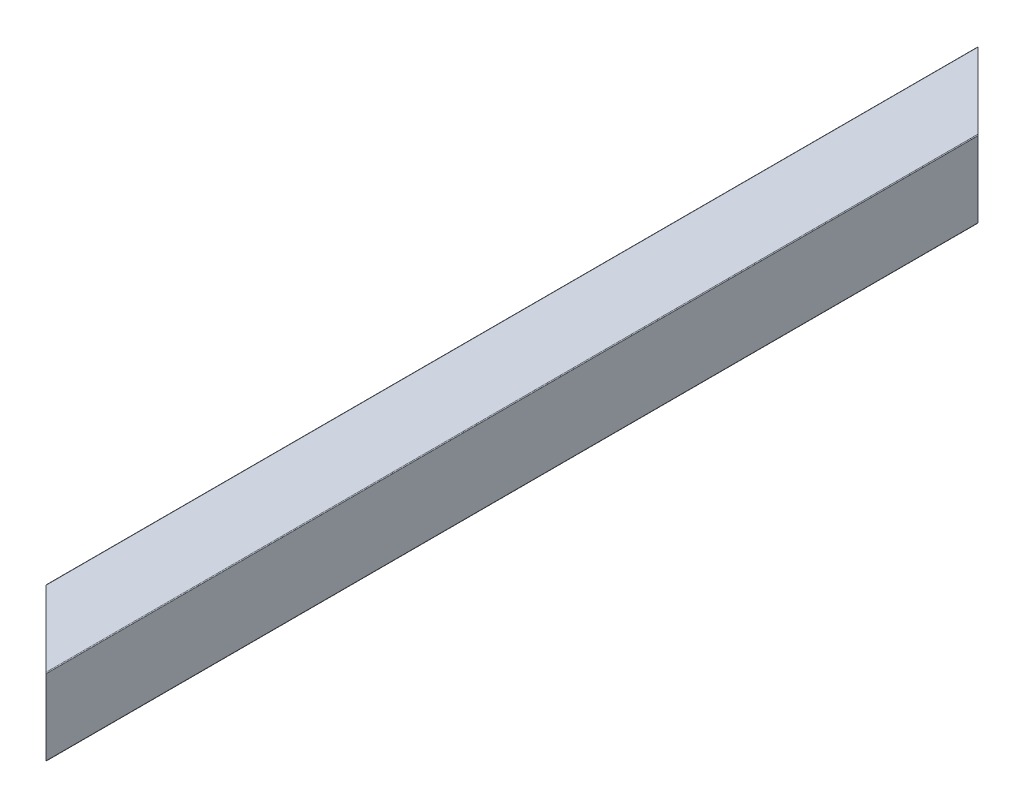
ISO-10303-21;
HEADER;
FILE_DESCRIPTION(('STEP AP214'),'2;1');
FILE_NAME('part.step','',(''),(''),'','','');
FILE_SCHEMA(('AUTOMOTIVE_DESIGN { 1 0 10303 214 1 1 1 1 }'));
ENDSEC;
DATA;
#1=APPLICATION_CONTEXT('core data for automotive mechanical design processes');
#2=APPLICATION_PROTOCOL_DEFINITION('international standard','automotive_design',2000,#1);
#3=PRODUCT_CONTEXT('',#1,'mechanical');
#4=PRODUCT('Part','Part','',(#3));
#5=PRODUCT_RELATED_PRODUCT_CATEGORY('part','',(#4));
#6=PRODUCT_DEFINITION_FORMATION('','',#4);
#7=PRODUCT_DEFINITION_CONTEXT('part definition',#1,'design');
#8=PRODUCT_DEFINITION('design','',#6,#7);
#9=PRODUCT_DEFINITION_SHAPE('','',#8);
#10=(LENGTH_UNIT() NAMED_UNIT(*) SI_UNIT(.MILLI.,.METRE.));
#11=(NAMED_UNIT(*) PLANE_ANGLE_UNIT() SI_UNIT($,.RADIAN.));
#12=(NAMED_UNIT(*) SI_UNIT($,.STERADIAN.) SOLID_ANGLE_UNIT());
#13=UNCERTAINTY_MEASURE_WITH_UNIT(LENGTH_MEASURE(1.E-05),#10,'distance_accuracy_value','');
#14=(GEOMETRIC_REPRESENTATION_CONTEXT(3) GLOBAL_UNCERTAINTY_ASSIGNED_CONTEXT((#13)) GLOBAL_UNIT_ASSIGNED_CONTEXT((#10,
#11,#12)) REPRESENTATION_CONTEXT('',''));
#15=CARTESIAN_POINT('',(0.,0.,0.));
#16=DIRECTION('',(0.,0.,1.));
#17=DIRECTION('',(1.,0.,0.));
#18=AXIS2_PLACEMENT_3D('',#15,#16,#17);
#19=CARTESIAN_POINT('',(3.175,4.7625,1828.8));
#20=DIRECTION('',(1.,0.,0.));
#21=DIRECTION('',(0.,1.,0.));
#22=AXIS2_PLACEMENT_3D('',#19,#20,#21);
#23=PLANE('',#22);
#24=DIRECTION('',(0.,1.,0.));
#25=VECTOR('',#24,1.);
#26=CARTESIAN_POINT('',(3.175,4.7625,1806.575));
#27=LINE('',#26,#25);
#28=CARTESIAN_POINT('',(3.175,4.7625,1806.575));
#29=VERTEX_POINT('',#28);
#30=CARTESIAN_POINT('',(3.175,20.6375,1806.575));
#31=VERTEX_POINT('',#30);
#32=EDGE_CURVE('E334',#29,#31,#27,.T.);
#33=ORIENTED_EDGE('',*,*,#32,.F.);
#34=DIRECTION('',(0.,0.,-1.));
#35=VECTOR('',#34,1.);
#36=CARTESIAN_POINT('',(3.175,4.7625,1828.8));
#37=LINE('',#36,#35);
#38=CARTESIAN_POINT('',(3.175,4.7625,1498.219));
#39=VERTEX_POINT('',#38);
#40=EDGE_CURVE('E69',#29,#39,#37,.T.);
#41=ORIENTED_EDGE('',*,*,#40,.T.);
#42=DIRECTION('',(0.,-1.,0.));
#43=VECTOR('',#42,1.);
#44=CARTESIAN_POINT('',(3.175,4.7625,1498.219));
#45=LINE('',#44,#43);
#46=CARTESIAN_POINT('',(3.175,20.6375,1498.219));
#47=VERTEX_POINT('',#46);
#48=EDGE_CURVE('E282',#47,#39,#45,.T.);
#49=ORIENTED_EDGE('',*,*,#48,.F.);
#50=DIRECTION('',(0.,0.,-1.));
#51=VECTOR('',#50,1.);
#52=CARTESIAN_POINT('',(3.175,20.6375,1828.8));
#53=LINE('',#52,#51);
#54=EDGE_CURVE('E11',#31,#47,#53,.T.);
#55=ORIENTED_EDGE('',*,*,#54,.F.);
#56=EDGE_LOOP('',(#33,#41,#49,#55));
#57=FACE_BOUND('',#56,.T.);
#58=ADVANCED_FACE('F43',(#57),#23,.T.);
#59=CARTESIAN_POINT('',(4.7625,20.6375,1828.8));
#60=DIRECTION('',(0.,0.,-1.));
#61=DIRECTION('',(-1.,0.,0.));
#62=AXIS2_PLACEMENT_3D('',#59,#60,#61);
#63=CYLINDRICAL_SURFACE('',#62,1.5875);
#64=DIRECTION('',(0.,0.,-1.));
#65=VECTOR('',#64,1.);
#66=CARTESIAN_POINT('',(4.7625,22.225,1828.8));
#67=LINE('',#66,#65);
#68=CARTESIAN_POINT('',(4.7625,22.225,1808.1625));
#69=VERTEX_POINT('',#68);
#70=CARTESIAN_POINT('',(4.7625,22.225,1499.8065));
#71=VERTEX_POINT('',#70);
#72=EDGE_CURVE('E53',#69,#71,#67,.T.);
#73=ORIENTED_EDGE('',*,*,#72,.F.);
#74=CARTESIAN_POINT('',(4.7625,20.6375,1808.1625));
#75=DIRECTION('',(0.707106781186545,0.,-0.70710678118655));
#76=DIRECTION('',(-0.70710678118655,0.,-0.707106781186545));
#77=AXIS2_PLACEMENT_3D('',#74,#75,#76);
#78=ELLIPSE('',#77,2.24506403026728,1.5875);
#79=EDGE_CURVE('E327',#69,#31,#78,.F.);
#80=ORIENTED_EDGE('',*,*,#79,.T.);
#81=ORIENTED_EDGE('',*,*,#54,.T.);
#82=CARTESIAN_POINT('',(4.7625,20.6375,1499.8065));
#83=DIRECTION('',(-0.707106781186546,0.,0.707106781186549));
#84=DIRECTION('',(-0.707106781186549,0.,-0.707106781186546));
#85=AXIS2_PLACEMENT_3D('',#82,#83,#84);
#86=ELLIPSE('',#85,2.24506403026728,1.5875);
#87=EDGE_CURVE('E275',#47,#71,#86,.F.);
#88=ORIENTED_EDGE('',*,*,#87,.T.);
#89=EDGE_LOOP('',(#73,#80,#81,#88));
#90=FACE_BOUND('',#89,.T.);
#91=ADVANCED_FACE('F280',(#90),#63,.F.);
#92=CARTESIAN_POINT('',(4.7625,22.225,1828.8));
#93=DIRECTION('',(0.,-1.,0.));
#94=DIRECTION('',(0.,0.,-1.));
#95=AXIS2_PLACEMENT_3D('',#92,#93,#94);
#96=PLANE('',#95);
#97=DIRECTION('',(0.70710678118655,0.,0.707106781186545));
#98=VECTOR('',#97,1.);
#99=CARTESIAN_POINT('',(15.08125,22.225,1818.48125));
#100=LINE('',#99,#98);
#101=CARTESIAN_POINT('',(20.6375,22.225,1824.0375));
#102=VERTEX_POINT('',#101);
#103=EDGE_CURVE('E266',#69,#102,#100,.T.);
#104=ORIENTED_EDGE('',*,*,#103,.F.);
#105=ORIENTED_EDGE('',*,*,#72,.T.);
#106=DIRECTION('',(-0.707106781186549,0.,-0.707106781186546));
#107=VECTOR('',#106,1.);
#108=CARTESIAN_POINT('',(169.25925,22.225,1664.30325));
#109=LINE('',#108,#107);
#110=CARTESIAN_POINT('',(20.6375,22.225,1515.6815));
#111=VERTEX_POINT('',#110);
#112=EDGE_CURVE('E265',#111,#71,#109,.T.);
#113=ORIENTED_EDGE('',*,*,#112,.F.);
#114=DIRECTION('',(0.,0.,-1.));
#115=VECTOR('',#114,1.);
#116=CARTESIAN_POINT('',(20.6375,22.225,1828.8));
#117=LINE('',#116,#115);
#118=EDGE_CURVE('E252',#102,#111,#117,.T.);
#119=ORIENTED_EDGE('',*,*,#118,.F.);
#120=EDGE_LOOP('',(#104,#105,#113,#119));
#121=FACE_BOUND('',#120,.T.);
#122=ADVANCED_FACE('F263',(#121),#96,.T.);
#123=CARTESIAN_POINT('',(20.6375,20.6375,1828.8));
#124=DIRECTION('',(0.,0.,-1.));
#125=DIRECTION('',(-1.,0.,0.));
#126=AXIS2_PLACEMENT_3D('',#123,#124,#125);
#127=CYLINDRICAL_SURFACE('',#126,1.5875);
#128=DIRECTION('',(0.,0.,-1.));
#129=VECTOR('',#128,1.);
#130=CARTESIAN_POINT('',(22.225,20.6375,1828.8));
#131=LINE('',#130,#129);
#132=CARTESIAN_POINT('',(22.225,20.6375,1825.625));
#133=VERTEX_POINT('',#132);
#134=CARTESIAN_POINT('',(22.225,20.6375,1517.269));
#135=VERTEX_POINT('',#134);
#136=EDGE_CURVE('E198',#133,#135,#131,.T.);
#137=ORIENTED_EDGE('',*,*,#136,.F.);
#138=CARTESIAN_POINT('',(20.6375,20.6375,1824.0375));
#139=DIRECTION('',(0.707106781186545,0.,-0.70710678118655));
#140=DIRECTION('',(-0.70710678118655,0.,-0.707106781186545));
#141=AXIS2_PLACEMENT_3D('',#138,#139,#140);
#142=ELLIPSE('',#141,2.24506403026728,1.5875);
#143=EDGE_CURVE('E323',#133,#102,#142,.F.);
#144=ORIENTED_EDGE('',*,*,#143,.T.);
#145=ORIENTED_EDGE('',*,*,#118,.T.);
#146=CARTESIAN_POINT('',(20.6375,20.6375,1515.6815));
#147=DIRECTION('',(-0.707106781186546,0.,0.707106781186549));
#148=DIRECTION('',(-0.707106781186549,0.,-0.707106781186546));
#149=AXIS2_PLACEMENT_3D('',#146,#147,#148);
#150=ELLIPSE('',#149,2.24506403026728,1.5875);
#151=EDGE_CURVE('E278',#111,#135,#150,.F.);
#152=ORIENTED_EDGE('',*,*,#151,.T.);
#153=EDGE_LOOP('',(#137,#144,#145,#152));
#154=FACE_BOUND('',#153,.T.);
#155=ADVANCED_FACE('F321',(#154),#127,.F.);
#156=CARTESIAN_POINT('',(22.225,4.7625,1828.8));
#157=DIRECTION('',(-1.,0.,0.));
#158=DIRECTION('',(0.,0.,1.));
#159=AXIS2_PLACEMENT_3D('',#156,#157,#158);
#160=PLANE('',#159);
#161=DIRECTION('',(0.,-1.,0.));
#162=VECTOR('',#161,1.);
#163=CARTESIAN_POINT('',(22.225,4.7625,1825.625));
#164=LINE('',#163,#162);
#165=CARTESIAN_POINT('',(22.225,4.7625,1825.625));
#166=VERTEX_POINT('',#165);
#167=EDGE_CURVE('E325',#133,#166,#164,.T.);
#168=ORIENTED_EDGE('',*,*,#167,.F.);
#169=ORIENTED_EDGE('',*,*,#136,.T.);
#170=DIRECTION('',(0.,1.,0.));
#171=VECTOR('',#170,1.);
#172=CARTESIAN_POINT('',(22.225,4.7625,1517.269));
#173=LINE('',#172,#171);
#174=CARTESIAN_POINT('',(22.225,4.7625,1517.269));
#175=VERTEX_POINT('',#174);
#176=EDGE_CURVE('E318',#175,#135,#173,.T.);
#177=ORIENTED_EDGE('',*,*,#176,.F.);
#178=DIRECTION('',(0.,0.,-1.));
#179=VECTOR('',#178,1.);
#180=CARTESIAN_POINT('',(22.225,4.7625,1828.8));
#181=LINE('',#180,#179);
#182=EDGE_CURVE('E209',#166,#175,#181,.T.);
#183=ORIENTED_EDGE('',*,*,#182,.F.);
#184=EDGE_LOOP('',(#168,#169,#177,#183));
#185=FACE_BOUND('',#184,.T.);
#186=ADVANCED_FACE('F362',(#185),#160,.T.);
#187=CARTESIAN_POINT('',(20.6375,4.7625,1828.8));
#188=DIRECTION('',(0.,0.,-1.));
#189=DIRECTION('',(-1.,0.,0.));
#190=AXIS2_PLACEMENT_3D('',#187,#188,#189);
#191=CYLINDRICAL_SURFACE('',#190,1.5875);
#192=DIRECTION('',(0.,0.,-1.));
#193=VECTOR('',#192,1.);
#194=CARTESIAN_POINT('',(20.6375,3.175,1828.8));
#195=LINE('',#194,#193);
#196=CARTESIAN_POINT('',(20.6375,3.175,1824.0375));
#197=VERTEX_POINT('',#196);
#198=CARTESIAN_POINT('',(20.6375,3.175,1515.6815));
#199=VERTEX_POINT('',#198);
#200=EDGE_CURVE('E207',#197,#199,#195,.T.);
#201=ORIENTED_EDGE('',*,*,#200,.F.);
#202=CARTESIAN_POINT('',(20.6375,4.7625,1824.0375));
#203=DIRECTION('',(0.707106781186545,0.,-0.70710678118655));
#204=DIRECTION('',(-0.70710678118655,0.,-0.707106781186545));
#205=AXIS2_PLACEMENT_3D('',#202,#203,#204);
#206=ELLIPSE('',#205,2.24506403026728,1.5875);
#207=EDGE_CURVE('E329',#197,#166,#206,.F.);
#208=ORIENTED_EDGE('',*,*,#207,.T.);
#209=ORIENTED_EDGE('',*,*,#182,.T.);
#210=CARTESIAN_POINT('',(20.6375,4.7625,1515.6815));
#211=DIRECTION('',(-0.707106781186546,0.,0.707106781186549));
#212=DIRECTION('',(-0.707106781186549,0.,-0.707106781186546));
#213=AXIS2_PLACEMENT_3D('',#210,#211,#212);
#214=ELLIPSE('',#213,2.24506403026728,1.5875);
#215=EDGE_CURVE('E315',#175,#199,#214,.F.);
#216=ORIENTED_EDGE('',*,*,#215,.T.);
#217=EDGE_LOOP('',(#201,#208,#209,#216));
#218=FACE_BOUND('',#217,.T.);
#219=ADVANCED_FACE('F358',(#218),#191,.F.);
#220=CARTESIAN_POINT('',(4.7625,3.175,1828.8));
#221=DIRECTION('',(0.,1.,0.));
#222=DIRECTION('',(1.,0.,0.));
#223=AXIS2_PLACEMENT_3D('',#220,#221,#222);
#224=PLANE('',#223);
#225=DIRECTION('',(-0.70710678118655,0.,-0.707106781186545));
#226=VECTOR('',#225,1.);
#227=CARTESIAN_POINT('',(15.08125,3.175,1818.48125));
#228=LINE('',#227,#226);
#229=CARTESIAN_POINT('',(4.7625,3.175,1808.1625));
#230=VERTEX_POINT('',#229);
#231=EDGE_CURVE('E61',#197,#230,#228,.T.);
#232=ORIENTED_EDGE('',*,*,#231,.F.);
#233=ORIENTED_EDGE('',*,*,#200,.T.);
#234=DIRECTION('',(0.707106781186549,0.,0.707106781186546));
#235=VECTOR('',#234,1.);
#236=CARTESIAN_POINT('',(169.25925,3.175,1664.30325));
#237=LINE('',#236,#235);
#238=CARTESIAN_POINT('',(4.7625,3.175,1499.8065));
#239=VERTEX_POINT('',#238);
#240=EDGE_CURVE('E313',#239,#199,#237,.T.);
#241=ORIENTED_EDGE('',*,*,#240,.F.);
#242=DIRECTION('',(0.,0.,-1.));
#243=VECTOR('',#242,1.);
#244=CARTESIAN_POINT('',(4.7625,3.175,1828.8));
#245=LINE('',#244,#243);
#246=EDGE_CURVE('E210',#230,#239,#245,.T.);
#247=ORIENTED_EDGE('',*,*,#246,.F.);
#248=EDGE_LOOP('',(#232,#233,#241,#247));
#249=FACE_BOUND('',#248,.T.);
#250=ADVANCED_FACE('F363',(#249),#224,.T.);
#251=CARTESIAN_POINT('',(4.7625,4.7625,1828.8));
#252=DIRECTION('',(0.,0.,-1.));
#253=DIRECTION('',(-1.,0.,0.));
#254=AXIS2_PLACEMENT_3D('',#251,#252,#253);
#255=CYLINDRICAL_SURFACE('',#254,1.5875);
#256=ORIENTED_EDGE('',*,*,#40,.F.);
#257=CARTESIAN_POINT('',(4.7625,4.7625,1808.1625));
#258=DIRECTION('',(0.707106781186545,0.,-0.70710678118655));
#259=DIRECTION('',(-0.70710678118655,0.,-0.707106781186545));
#260=AXIS2_PLACEMENT_3D('',#257,#258,#259);
#261=ELLIPSE('',#260,2.24506403026728,1.5875);
#262=EDGE_CURVE('E353',#29,#230,#261,.F.);
#263=ORIENTED_EDGE('',*,*,#262,.T.);
#264=ORIENTED_EDGE('',*,*,#246,.T.);
#265=CARTESIAN_POINT('',(4.7625,4.7625,1499.8065));
#266=DIRECTION('',(-0.707106781186546,0.,0.707106781186549));
#267=DIRECTION('',(-0.707106781186549,0.,-0.707106781186546));
#268=AXIS2_PLACEMENT_3D('',#265,#266,#267);
#269=ELLIPSE('',#268,2.24506403026728,1.5875);
#270=EDGE_CURVE('E311',#239,#39,#269,.F.);
#271=ORIENTED_EDGE('',*,*,#270,.T.);
#272=EDGE_LOOP('',(#256,#263,#264,#271));
#273=FACE_BOUND('',#272,.T.);
#274=ADVANCED_FACE('F365',(#273),#255,.F.);
#275=CARTESIAN_POINT('',(0.,0.254,1828.8));
#276=DIRECTION('',(1.,0.,0.));
#277=DIRECTION('',(0.,1.,0.));
#278=AXIS2_PLACEMENT_3D('',#275,#276,#277);
#279=PLANE('',#278);
#280=DIRECTION('',(0.,0.,-1.));
#281=VECTOR('',#280,1.);
#282=CARTESIAN_POINT('',(0.,0.254,1828.8));
#283=LINE('',#282,#281);
#284=CARTESIAN_POINT('',(0.,0.254,1803.4));
#285=VERTEX_POINT('',#284);
#286=CARTESIAN_POINT('',(0.,0.254,1495.044));
#287=VERTEX_POINT('',#286);
#288=EDGE_CURVE('E187',#285,#287,#283,.T.);
#289=ORIENTED_EDGE('',*,*,#288,.F.);
#290=DIRECTION('',(0.,1.,0.));
#291=VECTOR('',#290,1.);
#292=CARTESIAN_POINT('',(0.,0.254,1803.4));
#293=LINE('',#292,#291);
#294=CARTESIAN_POINT('',(0.,25.146,1803.4));
#295=VERTEX_POINT('',#294);
#296=EDGE_CURVE('E167',#285,#295,#293,.T.);
#297=ORIENTED_EDGE('',*,*,#296,.T.);
#298=DIRECTION('',(0.,0.,-1.));
#299=VECTOR('',#298,1.);
#300=CARTESIAN_POINT('',(0.,25.146,1828.8));
#301=LINE('',#300,#299);
#302=CARTESIAN_POINT('',(1.11022302462516E-13,25.1460000000001,1495.044));
#303=VERTEX_POINT('',#302);
#304=EDGE_CURVE('E206',#295,#303,#301,.T.);
#305=ORIENTED_EDGE('',*,*,#304,.T.);
#306=DIRECTION('',(0.,-1.,0.));
#307=VECTOR('',#306,1.);
#308=CARTESIAN_POINT('',(0.,0.254,1495.044));
#309=LINE('',#308,#307);
#310=EDGE_CURVE('E195',#303,#287,#309,.T.);
#311=ORIENTED_EDGE('',*,*,#310,.T.);
#312=EDGE_LOOP('',(#289,#297,#305,#311));
#313=FACE_BOUND('',#312,.T.);
#314=ADVANCED_FACE('F289',(#313),#279,.F.);
#315=CARTESIAN_POINT('',(0.254,25.146,1828.8));
#316=DIRECTION('',(0.,0.,-1.));
#317=DIRECTION('',(-1.,0.,0.));
#318=AXIS2_PLACEMENT_3D('',#315,#316,#317);
#319=CYLINDRICAL_SURFACE('',#318,0.254);
#320=CARTESIAN_POINT('',(0.254,25.146,1803.654));
#321=DIRECTION('',(0.707106781186545,0.,-0.70710678118655));
#322=DIRECTION('',(-0.70710678118655,0.,-0.707106781186545));
#323=AXIS2_PLACEMENT_3D('',#320,#321,#322);
#324=ELLIPSE('',#323,0.359210244842765,0.254);
#325=CARTESIAN_POINT('',(0.253999999999983,25.4,1803.654));
#326=VERTEX_POINT('',#325);
#327=EDGE_CURVE('E350',#326,#295,#324,.F.);
#328=ORIENTED_EDGE('',*,*,#327,.F.);
#329=DIRECTION('',(0.,0.,-1.));
#330=VECTOR('',#329,1.);
#331=CARTESIAN_POINT('',(0.254,25.4,1828.8));
#332=LINE('',#331,#330);
#333=CARTESIAN_POINT('',(0.253999999999942,25.4,1495.298));
#334=VERTEX_POINT('',#333);
#335=EDGE_CURVE('E203',#326,#334,#332,.T.);
#336=ORIENTED_EDGE('',*,*,#335,.T.);
#337=CARTESIAN_POINT('',(0.254,25.146,1495.298));
#338=DIRECTION('',(-0.707106781186546,0.,0.707106781186549));
#339=DIRECTION('',(-0.707106781186549,0.,-0.707106781186546));
#340=AXIS2_PLACEMENT_3D('',#337,#338,#339);
#341=ELLIPSE('',#340,0.359210244842765,0.254);
#342=EDGE_CURVE('E294',#303,#334,#341,.F.);
#343=ORIENTED_EDGE('',*,*,#342,.F.);
#344=ORIENTED_EDGE('',*,*,#304,.F.);
#345=EDGE_LOOP('',(#328,#336,#343,#344));
#346=FACE_BOUND('',#345,.T.);
#347=ADVANCED_FACE('F298',(#346),#319,.T.);
#348=CARTESIAN_POINT('',(0.254,25.4,1828.8));
#349=DIRECTION('',(0.,-1.,0.));
#350=DIRECTION('',(0.,0.,-1.));
#351=AXIS2_PLACEMENT_3D('',#348,#349,#350);
#352=PLANE('',#351);
#353=ORIENTED_EDGE('',*,*,#335,.F.);
#354=DIRECTION('',(-0.70710678118655,0.,-0.707106781186545));
#355=VECTOR('',#354,1.);
#356=CARTESIAN_POINT('',(34.1927663058368,25.4,1837.59276630584));
#357=LINE('',#356,#355);
#358=CARTESIAN_POINT('',(25.146,25.4,1828.546));
#359=VERTEX_POINT('',#358);
#360=EDGE_CURVE('E180',#359,#326,#357,.T.);
#361=ORIENTED_EDGE('',*,*,#360,.F.);
#362=DIRECTION('',(0.,0.,-1.));
#363=VECTOR('',#362,1.);
#364=CARTESIAN_POINT('',(25.146,25.4,1828.8));
#365=LINE('',#364,#363);
#366=CARTESIAN_POINT('',(25.146,25.4,1520.19));
#367=VERTEX_POINT('',#366);
#368=EDGE_CURVE('E200',#359,#367,#365,.T.);
#369=ORIENTED_EDGE('',*,*,#368,.T.);
#370=DIRECTION('',(0.707106781186549,0.,0.707106781186546));
#371=VECTOR('',#370,1.);
#372=CARTESIAN_POINT('',(35.8768679499491,25.4,1530.92086794995));
#373=LINE('',#372,#371);
#374=EDGE_CURVE('E336',#334,#367,#373,.T.);
#375=ORIENTED_EDGE('',*,*,#374,.F.);
#376=EDGE_LOOP('',(#353,#361,#369,#375));
#377=FACE_BOUND('',#376,.T.);
#378=ADVANCED_FACE('F393',(#377),#352,.F.);
#379=CARTESIAN_POINT('',(25.146,25.146,1828.8));
#380=DIRECTION('',(0.,0.,-1.));
#381=DIRECTION('',(-1.,0.,0.));
#382=AXIS2_PLACEMENT_3D('',#379,#380,#381);
#383=CYLINDRICAL_SURFACE('',#382,0.254);
#384=CARTESIAN_POINT('',(25.146,25.146,1828.546));
#385=DIRECTION('',(0.707106781186545,0.,-0.70710678118655));
#386=DIRECTION('',(-0.70710678118655,0.,-0.707106781186545));
#387=AXIS2_PLACEMENT_3D('',#384,#385,#386);
#388=ELLIPSE('',#387,0.359210244842765,0.254);
#389=CARTESIAN_POINT('',(25.4000000000002,25.146,1828.8));
#390=VERTEX_POINT('',#389);
#391=EDGE_CURVE('E343',#390,#359,#388,.F.);
#392=ORIENTED_EDGE('',*,*,#391,.F.);
#393=DIRECTION('',(0.,0.,-1.));
#394=VECTOR('',#393,1.);
#395=CARTESIAN_POINT('',(25.4,25.146,1828.8));
#396=LINE('',#395,#394);
#397=CARTESIAN_POINT('',(25.4,25.146,1520.444));
#398=VERTEX_POINT('',#397);
#399=EDGE_CURVE('E204',#390,#398,#396,.T.);
#400=ORIENTED_EDGE('',*,*,#399,.T.);
#401=CARTESIAN_POINT('',(25.146,25.146,1520.19));
#402=DIRECTION('',(-0.707106781186546,0.,0.707106781186549));
#403=DIRECTION('',(-0.707106781186549,0.,-0.707106781186546));
#404=AXIS2_PLACEMENT_3D('',#401,#402,#403);
#405=ELLIPSE('',#404,0.359210244842765,0.254);
#406=EDGE_CURVE('E309',#367,#398,#405,.F.);
#407=ORIENTED_EDGE('',*,*,#406,.F.);
#408=ORIENTED_EDGE('',*,*,#368,.F.);
#409=EDGE_LOOP('',(#392,#400,#407,#408));
#410=FACE_BOUND('',#409,.T.);
#411=ADVANCED_FACE('F45',(#410),#383,.T.);
#412=CARTESIAN_POINT('',(25.4,0.254,1828.8));
#413=DIRECTION('',(-1.,0.,0.));
#414=DIRECTION('',(0.,0.,1.));
#415=AXIS2_PLACEMENT_3D('',#412,#413,#414);
#416=PLANE('',#415);
#417=DIRECTION('',(0.,0.,-1.));
#418=VECTOR('',#417,1.);
#419=CARTESIAN_POINT('',(25.4,0.254,1828.8));
#420=LINE('',#419,#418);
#421=CARTESIAN_POINT('',(25.4,0.254,1828.8));
#422=VERTEX_POINT('',#421);
#423=CARTESIAN_POINT('',(25.4,0.254,1520.444));
#424=VERTEX_POINT('',#423);
#425=EDGE_CURVE('E233',#422,#424,#420,.T.);
#426=ORIENTED_EDGE('',*,*,#425,.T.);
#427=DIRECTION('',(0.,1.,0.));
#428=VECTOR('',#427,1.);
#429=CARTESIAN_POINT('',(25.4,0.254,1520.444));
#430=LINE('',#429,#428);
#431=EDGE_CURVE('E302',#424,#398,#430,.T.);
#432=ORIENTED_EDGE('',*,*,#431,.T.);
#433=ORIENTED_EDGE('',*,*,#399,.F.);
#434=DIRECTION('',(0.,1.,0.));
#435=VECTOR('',#434,1.);
#436=CARTESIAN_POINT('',(25.4,0.254,1828.8));
#437=LINE('',#436,#435);
#438=EDGE_CURVE('E47',#422,#390,#437,.T.);
#439=ORIENTED_EDGE('',*,*,#438,.F.);
#440=EDGE_LOOP('',(#426,#432,#433,#439));
#441=FACE_BOUND('',#440,.T.);
#442=ADVANCED_FACE('F344',(#441),#416,.F.);
#443=CARTESIAN_POINT('',(25.146,0.254,1828.8));
#444=DIRECTION('',(0.,0.,-1.));
#445=DIRECTION('',(-1.,0.,0.));
#446=AXIS2_PLACEMENT_3D('',#443,#444,#445);
#447=CYLINDRICAL_SURFACE('',#446,0.254);
#448=CARTESIAN_POINT('',(25.146,0.254,1828.546));
#449=DIRECTION('',(0.707106781186545,0.,-0.70710678118655));
#450=DIRECTION('',(-0.70710678118655,0.,-0.707106781186545));
#451=AXIS2_PLACEMENT_3D('',#448,#449,#450);
#452=ELLIPSE('',#451,0.359210244842765,0.254);
#453=CARTESIAN_POINT('',(25.146,0.,1828.546));
#454=VERTEX_POINT('',#453);
#455=EDGE_CURVE('E171',#454,#422,#452,.F.);
#456=ORIENTED_EDGE('',*,*,#455,.F.);
#457=DIRECTION('',(0.,0.,-1.));
#458=VECTOR('',#457,1.);
#459=CARTESIAN_POINT('',(25.146,0.,1828.8));
#460=LINE('',#459,#458);
#461=CARTESIAN_POINT('',(25.146,0.,1520.19));
#462=VERTEX_POINT('',#461);
#463=EDGE_CURVE('E179',#454,#462,#460,.T.);
#464=ORIENTED_EDGE('',*,*,#463,.T.);
#465=CARTESIAN_POINT('',(25.146,0.254,1520.19));
#466=DIRECTION('',(-0.707106781186546,0.,0.707106781186549));
#467=DIRECTION('',(-0.707106781186549,0.,-0.707106781186546));
#468=AXIS2_PLACEMENT_3D('',#465,#466,#467);
#469=ELLIPSE('',#468,0.359210244842765,0.254);
#470=EDGE_CURVE('E300',#424,#462,#469,.F.);
#471=ORIENTED_EDGE('',*,*,#470,.F.);
#472=ORIENTED_EDGE('',*,*,#425,.F.);
#473=EDGE_LOOP('',(#456,#464,#471,#472));
#474=FACE_BOUND('',#473,.T.);
#475=ADVANCED_FACE('F345',(#474),#447,.T.);
#476=CARTESIAN_POINT('',(0.254,0.,1828.8));
#477=DIRECTION('',(0.,1.,0.));
#478=DIRECTION('',(1.,0.,0.));
#479=AXIS2_PLACEMENT_3D('',#476,#477,#478);
#480=PLANE('',#479);
#481=ORIENTED_EDGE('',*,*,#463,.F.);
#482=DIRECTION('',(0.70710678118655,0.,0.707106781186545));
#483=VECTOR('',#482,1.);
#484=CARTESIAN_POINT('',(34.1927663058368,0.,1837.59276630584));
#485=LINE('',#484,#483);
#486=CARTESIAN_POINT('',(0.253999999999999,0.,1803.654));
#487=VERTEX_POINT('',#486);
#488=EDGE_CURVE('E164',#487,#454,#485,.T.);
#489=ORIENTED_EDGE('',*,*,#488,.F.);
#490=DIRECTION('',(0.,0.,-1.));
#491=VECTOR('',#490,1.);
#492=CARTESIAN_POINT('',(0.254,0.,1828.8));
#493=LINE('',#492,#491);
#494=CARTESIAN_POINT('',(0.253999999999988,0.,1495.298));
#495=VERTEX_POINT('',#494);
#496=EDGE_CURVE('E177',#487,#495,#493,.T.);
#497=ORIENTED_EDGE('',*,*,#496,.T.);
#498=DIRECTION('',(-0.707106781186549,0.,-0.707106781186546));
#499=VECTOR('',#498,1.);
#500=CARTESIAN_POINT('',(35.8768679499491,0.,1530.92086794995));
#501=LINE('',#500,#499);
#502=EDGE_CURVE('E304',#462,#495,#501,.T.);
#503=ORIENTED_EDGE('',*,*,#502,.F.);
#504=EDGE_LOOP('',(#481,#489,#497,#503));
#505=FACE_BOUND('',#504,.T.);
#506=ADVANCED_FACE('F175',(#505),#480,.F.);
#507=CARTESIAN_POINT('',(0.254,0.254,1828.8));
#508=DIRECTION('',(0.,0.,-1.));
#509=DIRECTION('',(-1.,0.,0.));
#510=AXIS2_PLACEMENT_3D('',#507,#508,#509);
#511=CYLINDRICAL_SURFACE('',#510,0.254);
#512=CARTESIAN_POINT('',(0.254,0.254,1803.654));
#513=DIRECTION('',(0.707106781186545,0.,-0.70710678118655));
#514=DIRECTION('',(-0.70710678118655,0.,-0.707106781186545));
#515=AXIS2_PLACEMENT_3D('',#512,#513,#514);
#516=ELLIPSE('',#515,0.359210244842765,0.254);
#517=EDGE_CURVE('E161',#285,#487,#516,.F.);
#518=ORIENTED_EDGE('',*,*,#517,.F.);
#519=ORIENTED_EDGE('',*,*,#288,.T.);
#520=CARTESIAN_POINT('',(0.254,0.254,1495.298));
#521=DIRECTION('',(-0.707106781186546,0.,0.707106781186549));
#522=DIRECTION('',(-0.707106781186549,0.,-0.707106781186546));
#523=AXIS2_PLACEMENT_3D('',#520,#521,#522);
#524=ELLIPSE('',#523,0.359210244842765,0.254);
#525=EDGE_CURVE('E185',#495,#287,#524,.F.);
#526=ORIENTED_EDGE('',*,*,#525,.F.);
#527=ORIENTED_EDGE('',*,*,#496,.F.);
#528=EDGE_LOOP('',(#518,#519,#526,#527));
#529=FACE_BOUND('',#528,.T.);
#530=ADVANCED_FACE('F183',(#529),#511,.T.);
#531=CARTESIAN_POINT('',(35.8768679499491,-76.1999999999999,1530.92086794995));
#532=DIRECTION('',(-0.707106781186546,0.,0.707106781186549));
#533=DIRECTION('',(0.707106781186549,0.,0.707106781186546));
#534=AXIS2_PLACEMENT_3D('',#531,#532,#533);
#535=PLANE('',#534);
#536=ORIENTED_EDGE('',*,*,#48,.T.);
#537=ORIENTED_EDGE('',*,*,#270,.F.);
#538=ORIENTED_EDGE('',*,*,#240,.T.);
#539=ORIENTED_EDGE('',*,*,#215,.F.);
#540=ORIENTED_EDGE('',*,*,#176,.T.);
#541=ORIENTED_EDGE('',*,*,#151,.F.);
#542=ORIENTED_EDGE('',*,*,#112,.T.);
#543=ORIENTED_EDGE('',*,*,#87,.F.);
#544=EDGE_LOOP('',(#536,#537,#538,#539,#540,#541,#542,#543));
#545=FACE_BOUND('',#544,.T.);
#546=ORIENTED_EDGE('',*,*,#406,.T.);
#547=ORIENTED_EDGE('',*,*,#431,.F.);
#548=ORIENTED_EDGE('',*,*,#470,.T.);
#549=ORIENTED_EDGE('',*,*,#502,.T.);
#550=ORIENTED_EDGE('',*,*,#525,.T.);
#551=ORIENTED_EDGE('',*,*,#310,.F.);
#552=ORIENTED_EDGE('',*,*,#342,.T.);
#553=ORIENTED_EDGE('',*,*,#374,.T.);
#554=EDGE_LOOP('',(#546,#547,#548,#549,#550,#551,#552,#553));
#555=FACE_BOUND('',#554,.T.);
#556=ADVANCED_FACE('F273',(#545,#555),#535,.F.);
#557=CARTESIAN_POINT('',(34.1927663058368,-76.1999999999998,1837.59276630584));
#558=DIRECTION('',(0.707106781186545,0.,-0.70710678118655));
#559=DIRECTION('',(-0.70710678118655,0.,-0.707106781186545));
#560=AXIS2_PLACEMENT_3D('',#557,#558,#559);
#561=PLANE('',#560);
#562=ORIENTED_EDGE('',*,*,#32,.T.);
#563=ORIENTED_EDGE('',*,*,#79,.F.);
#564=ORIENTED_EDGE('',*,*,#103,.T.);
#565=ORIENTED_EDGE('',*,*,#143,.F.);
#566=ORIENTED_EDGE('',*,*,#167,.T.);
#567=ORIENTED_EDGE('',*,*,#207,.F.);
#568=ORIENTED_EDGE('',*,*,#231,.T.);
#569=ORIENTED_EDGE('',*,*,#262,.F.);
#570=EDGE_LOOP('',(#562,#563,#564,#565,#566,#567,#568,#569));
#571=FACE_BOUND('',#570,.T.);
#572=ORIENTED_EDGE('',*,*,#391,.T.);
#573=ORIENTED_EDGE('',*,*,#360,.T.);
#574=ORIENTED_EDGE('',*,*,#327,.T.);
#575=ORIENTED_EDGE('',*,*,#296,.F.);
#576=ORIENTED_EDGE('',*,*,#517,.T.);
#577=ORIENTED_EDGE('',*,*,#488,.T.);
#578=ORIENTED_EDGE('',*,*,#455,.T.);
#579=ORIENTED_EDGE('',*,*,#438,.T.);
#580=EDGE_LOOP('',(#572,#573,#574,#575,#576,#577,#578,#579));
#581=FACE_BOUND('',#580,.T.);
#582=ADVANCED_FACE('F163',(#571,#581),#561,.F.);
#583=CLOSED_SHELL('',(#58,#91,#122,#155,#186,#219,#250,#274,#314,#347,#378,#411,#442,#475,#506,
#530,#556,#582));
#584=MANIFOLD_SOLID_BREP('B2',#583);
#585=ADVANCED_BREP_SHAPE_REPRESENTATION('',(#18,#584),#14);
#586=SHAPE_DEFINITION_REPRESENTATION(#9,#585);
ENDSEC;
END-ISO-10303-21;
